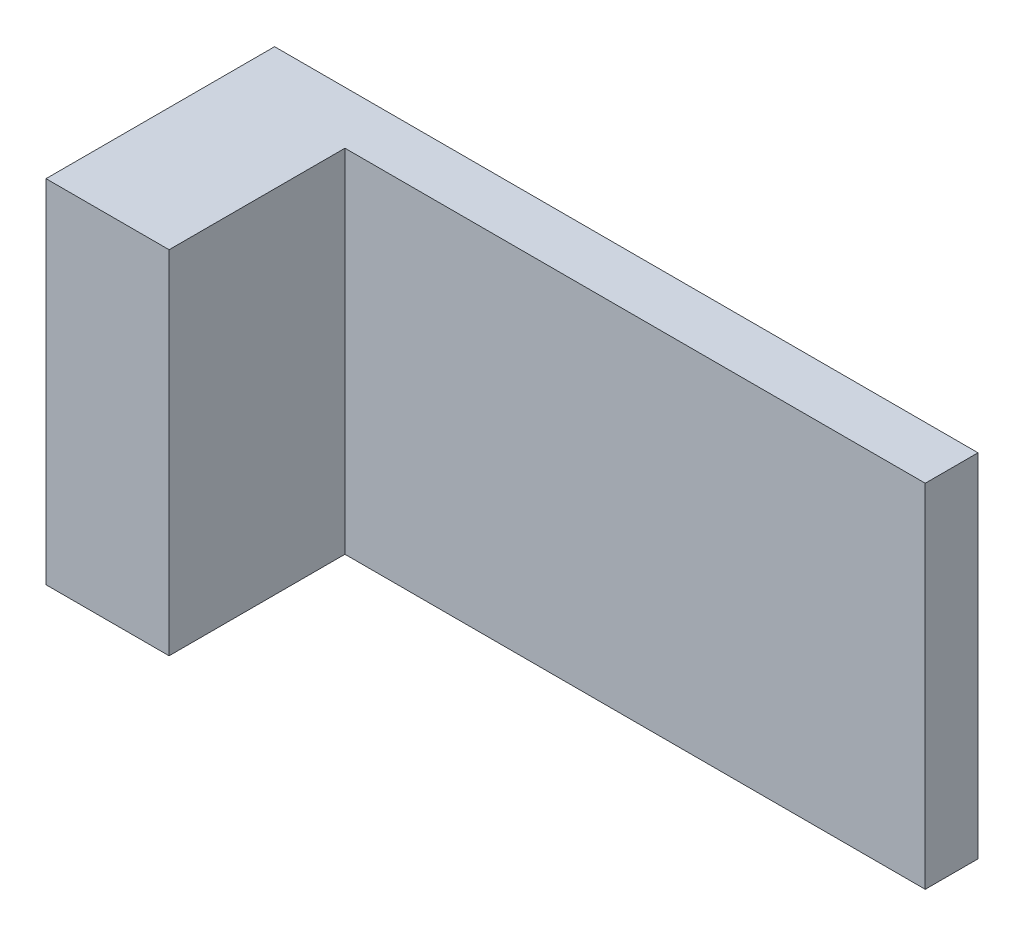
ISO-10303-21;
HEADER;
FILE_DESCRIPTION(('STEP AP214'),'2;1');
FILE_NAME('part.step','',(''),(''),'','','');
FILE_SCHEMA(('AUTOMOTIVE_DESIGN { 1 0 10303 214 1 1 1 1 }'));
ENDSEC;
DATA;
#1=APPLICATION_CONTEXT('core data for automotive mechanical design processes');
#2=APPLICATION_PROTOCOL_DEFINITION('international standard','automotive_design',2000,#1);
#3=PRODUCT_CONTEXT('',#1,'mechanical');
#4=PRODUCT('Part','Part','',(#3));
#5=PRODUCT_RELATED_PRODUCT_CATEGORY('part','',(#4));
#6=PRODUCT_DEFINITION_FORMATION('','',#4);
#7=PRODUCT_DEFINITION_CONTEXT('part definition',#1,'design');
#8=PRODUCT_DEFINITION('design','',#6,#7);
#9=PRODUCT_DEFINITION_SHAPE('','',#8);
#10=(LENGTH_UNIT() NAMED_UNIT(*) SI_UNIT(.MILLI.,.METRE.));
#11=(NAMED_UNIT(*) PLANE_ANGLE_UNIT() SI_UNIT($,.RADIAN.));
#12=(NAMED_UNIT(*) SI_UNIT($,.STERADIAN.) SOLID_ANGLE_UNIT());
#13=UNCERTAINTY_MEASURE_WITH_UNIT(LENGTH_MEASURE(1.E-05),#10,'distance_accuracy_value','');
#14=(GEOMETRIC_REPRESENTATION_CONTEXT(3) GLOBAL_UNCERTAINTY_ASSIGNED_CONTEXT((#13)) GLOBAL_UNIT_ASSIGNED_CONTEXT((#10,
#11,#12)) REPRESENTATION_CONTEXT('',''));
#15=CARTESIAN_POINT('',(0.,0.,0.));
#16=DIRECTION('',(0.,0.,1.));
#17=DIRECTION('',(1.,0.,0.));
#18=AXIS2_PLACEMENT_3D('',#15,#16,#17);
#19=CARTESIAN_POINT('',(0.,0.,1.5));
#20=DIRECTION('',(0.,0.,-1.));
#21=DIRECTION('',(-1.,0.,0.));
#22=AXIS2_PLACEMENT_3D('',#19,#20,#21);
#23=PLANE('',#22);
#24=DIRECTION('',(0.,1.,0.));
#25=VECTOR('',#24,1.);
#26=CARTESIAN_POINT('',(-13.,10.,1.5));
#27=LINE('',#26,#25);
#28=CARTESIAN_POINT('',(-13.,-10.,1.5));
#29=VERTEX_POINT('',#28);
#30=CARTESIAN_POINT('',(-13.,10.,1.5));
#31=VERTEX_POINT('',#30);
#32=EDGE_CURVE('E48',#29,#31,#27,.T.);
#33=ORIENTED_EDGE('',*,*,#32,.F.);
#34=DIRECTION('',(1.,0.,0.));
#35=VECTOR('',#34,1.);
#36=CARTESIAN_POINT('',(-20.,-10.,1.5));
#37=LINE('',#36,#35);
#38=CARTESIAN_POINT('',(20.,-10.,1.5));
#39=VERTEX_POINT('',#38);
#40=EDGE_CURVE('E53',#29,#39,#37,.T.);
#41=ORIENTED_EDGE('',*,*,#40,.T.);
#42=DIRECTION('',(0.,1.,0.));
#43=VECTOR('',#42,1.);
#44=CARTESIAN_POINT('',(20.,-10.,1.5));
#45=LINE('',#44,#43);
#46=CARTESIAN_POINT('',(20.,10.,1.5));
#47=VERTEX_POINT('',#46);
#48=EDGE_CURVE('E84',#39,#47,#45,.T.);
#49=ORIENTED_EDGE('',*,*,#48,.T.);
#50=DIRECTION('',(-1.,0.,0.));
#51=VECTOR('',#50,1.);
#52=CARTESIAN_POINT('',(-20.,10.,1.5));
#53=LINE('',#52,#51);
#54=EDGE_CURVE('E134',#47,#31,#53,.T.);
#55=ORIENTED_EDGE('',*,*,#54,.T.);
#56=EDGE_LOOP('',(#33,#41,#49,#55));
#57=FACE_BOUND('',#56,.T.);
#58=ADVANCED_FACE('F33',(#57),#23,.F.);
#59=CARTESIAN_POINT('',(20.,-10.,1.5));
#60=DIRECTION('',(-1.,0.,0.));
#61=DIRECTION('',(0.,0.,1.));
#62=AXIS2_PLACEMENT_3D('',#59,#60,#61);
#63=PLANE('',#62);
#64=DIRECTION('',(0.,1.,0.));
#65=VECTOR('',#64,1.);
#66=CARTESIAN_POINT('',(20.,-10.,-1.5));
#67=LINE('',#66,#65);
#68=CARTESIAN_POINT('',(20.,-10.,-1.5));
#69=VERTEX_POINT('',#68);
#70=CARTESIAN_POINT('',(20.,10.,-1.5));
#71=VERTEX_POINT('',#70);
#72=EDGE_CURVE('E90',#69,#71,#67,.T.);
#73=ORIENTED_EDGE('',*,*,#72,.T.);
#74=DIRECTION('',(0.,0.,-1.));
#75=VECTOR('',#74,1.);
#76=CARTESIAN_POINT('',(20.,10.,1.5));
#77=LINE('',#76,#75);
#78=EDGE_CURVE('E11',#47,#71,#77,.T.);
#79=ORIENTED_EDGE('',*,*,#78,.F.);
#80=ORIENTED_EDGE('',*,*,#48,.F.);
#81=DIRECTION('',(0.,0.,-1.));
#82=VECTOR('',#81,1.);
#83=CARTESIAN_POINT('',(20.,-10.,1.5));
#84=LINE('',#83,#82);
#85=EDGE_CURVE('E76',#39,#69,#84,.T.);
#86=ORIENTED_EDGE('',*,*,#85,.T.);
#87=EDGE_LOOP('',(#73,#79,#80,#86));
#88=FACE_BOUND('',#87,.T.);
#89=ADVANCED_FACE('F35',(#88),#63,.F.);
#90=CARTESIAN_POINT('',(-20.,10.,1.5));
#91=DIRECTION('',(0.,-1.,0.));
#92=DIRECTION('',(0.,0.,-1.));
#93=AXIS2_PLACEMENT_3D('',#90,#91,#92);
#94=PLANE('',#93);
#95=DIRECTION('',(-1.,0.,0.));
#96=VECTOR('',#95,1.);
#97=CARTESIAN_POINT('',(-20.,10.,-1.5));
#98=LINE('',#97,#96);
#99=CARTESIAN_POINT('',(-20.,10.,-1.5));
#100=VERTEX_POINT('',#99);
#101=EDGE_CURVE('E93',#71,#100,#98,.T.);
#102=ORIENTED_EDGE('',*,*,#101,.T.);
#103=DIRECTION('',(0.,0.,-1.));
#104=VECTOR('',#103,1.);
#105=CARTESIAN_POINT('',(-20.,10.,1.5));
#106=LINE('',#105,#104);
#107=CARTESIAN_POINT('',(-20.,10.,11.5));
#108=VERTEX_POINT('',#107);
#109=EDGE_CURVE('E41',#108,#100,#106,.T.);
#110=ORIENTED_EDGE('',*,*,#109,.F.);
#111=DIRECTION('',(-1.,0.,0.));
#112=VECTOR('',#111,1.);
#113=CARTESIAN_POINT('',(-20.,10.,11.5));
#114=LINE('',#113,#112);
#115=CARTESIAN_POINT('',(-13.,10.,11.5));
#116=VERTEX_POINT('',#115);
#117=EDGE_CURVE('E117',#116,#108,#114,.T.);
#118=ORIENTED_EDGE('',*,*,#117,.F.);
#119=DIRECTION('',(0.,0.,-1.));
#120=VECTOR('',#119,1.);
#121=CARTESIAN_POINT('',(-13.,10.,11.5));
#122=LINE('',#121,#120);
#123=EDGE_CURVE('E98',#116,#31,#122,.T.);
#124=ORIENTED_EDGE('',*,*,#123,.T.);
#125=ORIENTED_EDGE('',*,*,#54,.F.);
#126=ORIENTED_EDGE('',*,*,#78,.T.);
#127=EDGE_LOOP('',(#102,#110,#118,#124,#125,#126));
#128=FACE_BOUND('',#127,.T.);
#129=ADVANCED_FACE('F114',(#128),#94,.F.);
#130=CARTESIAN_POINT('',(-20.,-10.,1.5));
#131=DIRECTION('',(1.,0.,0.));
#132=DIRECTION('',(0.,0.,-1.));
#133=AXIS2_PLACEMENT_3D('',#130,#131,#132);
#134=PLANE('',#133);
#135=DIRECTION('',(0.,-1.,0.));
#136=VECTOR('',#135,1.);
#137=CARTESIAN_POINT('',(-20.,-10.,-1.5));
#138=LINE('',#137,#136);
#139=CARTESIAN_POINT('',(-20.,-10.,-1.5));
#140=VERTEX_POINT('',#139);
#141=EDGE_CURVE('E85',#100,#140,#138,.T.);
#142=ORIENTED_EDGE('',*,*,#141,.T.);
#143=DIRECTION('',(0.,0.,-1.));
#144=VECTOR('',#143,1.);
#145=CARTESIAN_POINT('',(-20.,-10.,1.5));
#146=LINE('',#145,#144);
#147=CARTESIAN_POINT('',(-20.,-10.,11.5));
#148=VERTEX_POINT('',#147);
#149=EDGE_CURVE('E80',#148,#140,#146,.T.);
#150=ORIENTED_EDGE('',*,*,#149,.F.);
#151=DIRECTION('',(0.,-1.,0.));
#152=VECTOR('',#151,1.);
#153=CARTESIAN_POINT('',(-20.,10.,11.5));
#154=LINE('',#153,#152);
#155=EDGE_CURVE('E110',#108,#148,#154,.T.);
#156=ORIENTED_EDGE('',*,*,#155,.F.);
#157=ORIENTED_EDGE('',*,*,#109,.T.);
#158=EDGE_LOOP('',(#142,#150,#156,#157));
#159=FACE_BOUND('',#158,.T.);
#160=ADVANCED_FACE('F108',(#159),#134,.F.);
#161=CARTESIAN_POINT('',(-20.,-10.,1.5));
#162=DIRECTION('',(0.,1.,0.));
#163=DIRECTION('',(0.,0.,1.));
#164=AXIS2_PLACEMENT_3D('',#161,#162,#163);
#165=PLANE('',#164);
#166=DIRECTION('',(1.,0.,0.));
#167=VECTOR('',#166,1.);
#168=CARTESIAN_POINT('',(-20.,-10.,-1.5));
#169=LINE('',#168,#167);
#170=EDGE_CURVE('E73',#140,#69,#169,.T.);
#171=ORIENTED_EDGE('',*,*,#170,.T.);
#172=ORIENTED_EDGE('',*,*,#85,.F.);
#173=ORIENTED_EDGE('',*,*,#40,.F.);
#174=DIRECTION('',(0.,0.,-1.));
#175=VECTOR('',#174,1.);
#176=CARTESIAN_POINT('',(-13.,-10.,11.5));
#177=LINE('',#176,#175);
#178=CARTESIAN_POINT('',(-13.,-10.,11.5));
#179=VERTEX_POINT('',#178);
#180=EDGE_CURVE('E94',#179,#29,#177,.T.);
#181=ORIENTED_EDGE('',*,*,#180,.F.);
#182=DIRECTION('',(1.,0.,0.));
#183=VECTOR('',#182,1.);
#184=CARTESIAN_POINT('',(-20.,-10.,11.5));
#185=LINE('',#184,#183);
#186=EDGE_CURVE('E129',#148,#179,#185,.T.);
#187=ORIENTED_EDGE('',*,*,#186,.F.);
#188=ORIENTED_EDGE('',*,*,#149,.T.);
#189=EDGE_LOOP('',(#171,#172,#173,#181,#187,#188));
#190=FACE_BOUND('',#189,.T.);
#191=ADVANCED_FACE('F75',(#190),#165,.F.);
#192=CARTESIAN_POINT('',(0.,0.,-1.5));
#193=DIRECTION('',(0.,0.,-1.));
#194=DIRECTION('',(-1.,0.,0.));
#195=AXIS2_PLACEMENT_3D('',#192,#193,#194);
#196=PLANE('',#195);
#197=ORIENTED_EDGE('',*,*,#72,.F.);
#198=ORIENTED_EDGE('',*,*,#170,.F.);
#199=ORIENTED_EDGE('',*,*,#141,.F.);
#200=ORIENTED_EDGE('',*,*,#101,.F.);
#201=EDGE_LOOP('',(#197,#198,#199,#200));
#202=FACE_BOUND('',#201,.T.);
#203=ADVANCED_FACE('F92',(#202),#196,.T.);
#204=CARTESIAN_POINT('',(-13.,10.,11.5));
#205=DIRECTION('',(-1.,0.,0.));
#206=DIRECTION('',(0.,-1.,0.));
#207=AXIS2_PLACEMENT_3D('',#204,#205,#206);
#208=PLANE('',#207);
#209=ORIENTED_EDGE('',*,*,#32,.T.);
#210=ORIENTED_EDGE('',*,*,#123,.F.);
#211=DIRECTION('',(0.,1.,0.));
#212=VECTOR('',#211,1.);
#213=CARTESIAN_POINT('',(-13.,10.,11.5));
#214=LINE('',#213,#212);
#215=EDGE_CURVE('E125',#179,#116,#214,.T.);
#216=ORIENTED_EDGE('',*,*,#215,.F.);
#217=ORIENTED_EDGE('',*,*,#180,.T.);
#218=EDGE_LOOP('',(#209,#210,#216,#217));
#219=FACE_BOUND('',#218,.T.);
#220=ADVANCED_FACE('F137',(#219),#208,.F.);
#221=CARTESIAN_POINT('',(0.,0.,11.5));
#222=DIRECTION('',(0.,0.,1.));
#223=DIRECTION('',(1.,0.,0.));
#224=AXIS2_PLACEMENT_3D('',#221,#222,#223);
#225=PLANE('',#224);
#226=ORIENTED_EDGE('',*,*,#155,.T.);
#227=ORIENTED_EDGE('',*,*,#186,.T.);
#228=ORIENTED_EDGE('',*,*,#215,.T.);
#229=ORIENTED_EDGE('',*,*,#117,.T.);
#230=EDGE_LOOP('',(#226,#227,#228,#229));
#231=FACE_BOUND('',#230,.T.);
#232=ADVANCED_FACE('F121',(#231),#225,.T.);
#233=CLOSED_SHELL('',(#58,#89,#129,#160,#191,#203,#220,#232));
#234=MANIFOLD_SOLID_BREP('B2',#233);
#235=ADVANCED_BREP_SHAPE_REPRESENTATION('',(#18,#234),#14);
#236=SHAPE_DEFINITION_REPRESENTATION(#9,#235);
ENDSEC;
END-ISO-10303-21;
